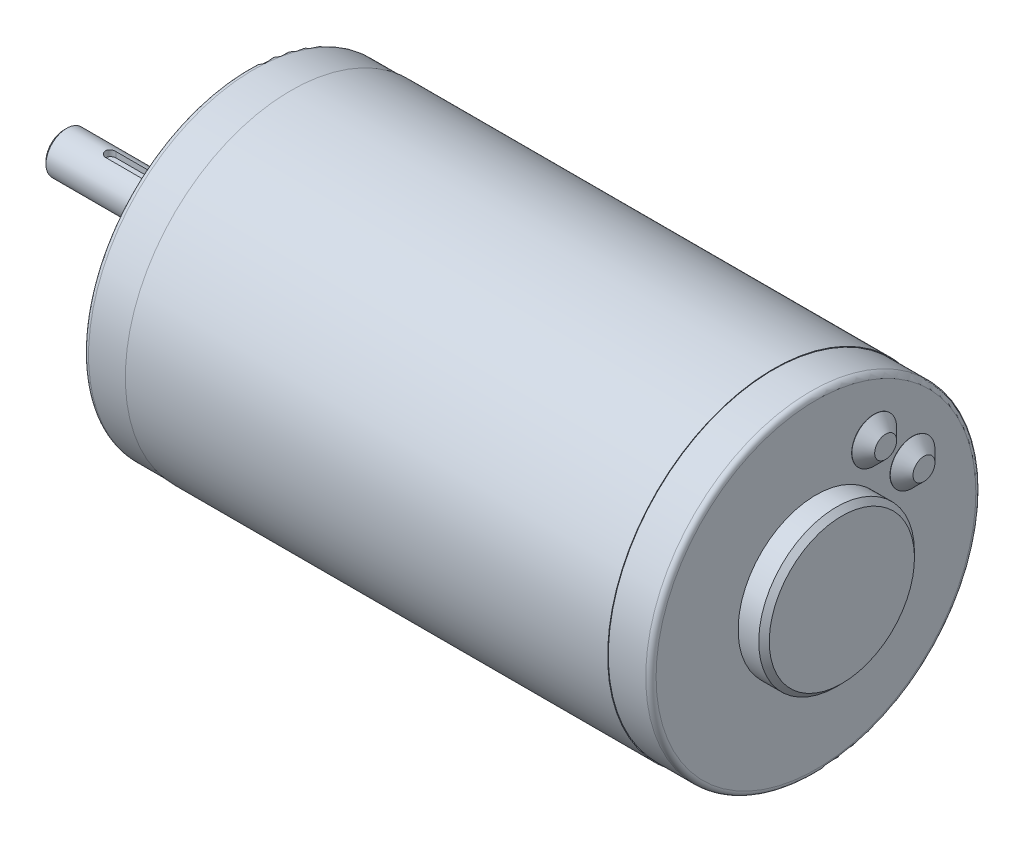
ISO-10303-21;
HEADER;
FILE_DESCRIPTION(('STEP AP214'),'2;1');
FILE_NAME('part.step','',(''),(''),'','','');
FILE_SCHEMA(('AUTOMOTIVE_DESIGN { 1 0 10303 214 1 1 1 1 }'));
ENDSEC;
DATA;
#1=APPLICATION_CONTEXT('core data for automotive mechanical design processes');
#2=APPLICATION_PROTOCOL_DEFINITION('international standard','automotive_design',2000,#1);
#3=PRODUCT_CONTEXT('',#1,'mechanical');
#4=PRODUCT('Part','Part','',(#3));
#5=PRODUCT_RELATED_PRODUCT_CATEGORY('part','',(#4));
#6=PRODUCT_DEFINITION_FORMATION('','',#4);
#7=PRODUCT_DEFINITION_CONTEXT('part definition',#1,'design');
#8=PRODUCT_DEFINITION('design','',#6,#7);
#9=PRODUCT_DEFINITION_SHAPE('','',#8);
#10=(LENGTH_UNIT() NAMED_UNIT(*) SI_UNIT(.MILLI.,.METRE.));
#11=(NAMED_UNIT(*) PLANE_ANGLE_UNIT() SI_UNIT($,.RADIAN.));
#12=(NAMED_UNIT(*) SI_UNIT($,.STERADIAN.) SOLID_ANGLE_UNIT());
#13=UNCERTAINTY_MEASURE_WITH_UNIT(LENGTH_MEASURE(1.E-05),#10,'distance_accuracy_value','');
#14=(GEOMETRIC_REPRESENTATION_CONTEXT(3) GLOBAL_UNCERTAINTY_ASSIGNED_CONTEXT((#13)) GLOBAL_UNIT_ASSIGNED_CONTEXT((#10,
#11,#12)) REPRESENTATION_CONTEXT('',''));
#15=CARTESIAN_POINT('',(0.,0.,0.));
#16=DIRECTION('',(0.,0.,1.));
#17=DIRECTION('',(1.,0.,0.));
#18=AXIS2_PLACEMENT_3D('',#15,#16,#17);
#19=CARTESIAN_POINT('',(-27.6,2.79999999999999,-1.));
#20=DIRECTION('',(0.,-1.,0.));
#21=DIRECTION('',(0.,0.,-1.));
#22=AXIS2_PLACEMENT_3D('',#19,#20,#21);
#23=PLANE('',#22);
#24=CARTESIAN_POINT('',(-7.1,2.79999999999999,0.));
#25=DIRECTION('',(0.,1.,0.));
#26=DIRECTION('',(0.,0.,1.));
#27=AXIS2_PLACEMENT_3D('',#24,#25,#26);
#28=CIRCLE('',#27,1.);
#29=CARTESIAN_POINT('',(-7.1,2.79999999999999,1.));
#30=VERTEX_POINT('',#29);
#31=CARTESIAN_POINT('',(-7.1,2.79999999999999,-1.));
#32=VERTEX_POINT('',#31);
#33=EDGE_CURVE('E79',#30,#32,#28,.T.);
#34=ORIENTED_EDGE('',*,*,#33,.T.);
#35=DIRECTION('',(1.,0.,0.));
#36=VECTOR('',#35,1.);
#37=CARTESIAN_POINT('',(-27.6,2.79999999999999,-1.));
#38=LINE('',#37,#36);
#39=CARTESIAN_POINT('',(-26.6,2.79999999999999,-1.));
#40=VERTEX_POINT('',#39);
#41=EDGE_CURVE('E74',#40,#32,#38,.T.);
#42=ORIENTED_EDGE('',*,*,#41,.F.);
#43=CARTESIAN_POINT('',(-26.6,2.79999999999999,0.));
#44=DIRECTION('',(0.,-1.,0.));
#45=DIRECTION('',(0.,0.,-1.));
#46=AXIS2_PLACEMENT_3D('',#43,#44,#45);
#47=CIRCLE('',#46,1.);
#48=CARTESIAN_POINT('',(-26.6,2.79999999999999,1.));
#49=VERTEX_POINT('',#48);
#50=EDGE_CURVE('E76',#40,#49,#47,.F.);
#51=ORIENTED_EDGE('',*,*,#50,.T.);
#52=DIRECTION('',(1.,0.,0.));
#53=VECTOR('',#52,1.);
#54=CARTESIAN_POINT('',(-27.6,2.79999999999999,1.));
#55=LINE('',#54,#53);
#56=EDGE_CURVE('E102',#49,#30,#55,.T.);
#57=ORIENTED_EDGE('',*,*,#56,.T.);
#58=EDGE_LOOP('',(#34,#42,#51,#57));
#59=FACE_BOUND('',#58,.T.);
#60=ADVANCED_FACE('F16',(#59),#23,.F.);
#61=CARTESIAN_POINT('',(-35.6,0.,0.));
#62=DIRECTION('',(-1.,0.,0.));
#63=DIRECTION('',(0.,0.,1.));
#64=AXIS2_PLACEMENT_3D('',#61,#62,#63);
#65=PLANE('',#64);
#66=CARTESIAN_POINT('',(-35.6000000000449,0.,0.));
#67=DIRECTION('',(1.,0.,0.));
#68=DIRECTION('',(0.,0.,-1.));
#69=AXIS2_PLACEMENT_3D('',#66,#67,#68);
#70=CIRCLE('',#69,3.49999999997408);
#71=CARTESIAN_POINT('',(-35.6000000000449,0.,-3.49999999997408));
#72=VERTEX_POINT('',#71);
#73=EDGE_CURVE('E327',#72,#72,#70,.T.);
#74=ORIENTED_EDGE('',*,*,#73,.F.);
#75=EDGE_LOOP('',(#74));
#76=FACE_BOUND('',#75,.T.);
#77=ADVANCED_FACE('F635',(#76),#65,.T.);
#78=CARTESIAN_POINT('',(-26.6,3.87298334620741,0.));
#79=DIRECTION('',(0.,-1.,0.));
#80=DIRECTION('',(0.,0.,-1.));
#81=AXIS2_PLACEMENT_3D('',#78,#79,#80);
#82=CYLINDRICAL_SURFACE('',#81,1.);
#83=CARTESIAN_POINT('',(-26.6,3.87298334620741,1.));
#84=CARTESIAN_POINT('',(-26.6276629851065,3.87298148580177,1.00000033749611));
#85=CARTESIAN_POINT('',(-26.6553122630182,3.8732800994947,0.998851407375366));
#86=CARTESIAN_POINT('',(-26.7104040353036,3.87445904774558,0.994271295395754));
#87=CARTESIAN_POINT('',(-26.7378465636871,3.87533928441687,0.990840497572679));
#88=CARTESIAN_POINT('',(-26.8194531732088,3.87881710972053,0.977175239382526));
#89=CARTESIAN_POINT('',(-26.8730564684822,3.88225203148808,0.963567695172493));
#90=CARTESIAN_POINT('',(-26.977124673782,3.89095422588002,0.927798076247996));
#91=CARTESIAN_POINT('',(-27.0275898782129,3.89622132630929,0.905636805423835));
#92=CARTESIAN_POINT('',(-27.1241114486473,3.90799134471939,0.853415378025864));
#93=CARTESIAN_POINT('',(-27.170166627891,3.91449459395647,0.823353103356932));
#94=CARTESIAN_POINT('',(-27.2575438819061,3.92816262398025,0.755484471828069));
#95=CARTESIAN_POINT('',(-27.2987548862455,3.93533791028915,0.717537268783975));
#96=CARTESIAN_POINT('',(-27.3743020894827,3.94945104396193,0.635275780516229));
#97=CARTESIAN_POINT('',(-27.4086371894679,3.95638885322537,0.59096047947883));
#98=CARTESIAN_POINT('',(-27.4699110016186,3.96936182283248,0.496456899401689));
#99=CARTESIAN_POINT('',(-27.496739895984,3.9753830468173,0.446195340334472));
#100=CARTESIAN_POINT('',(-27.5415247341967,3.98572346250588,0.341702590842916));
#101=CARTESIAN_POINT('',(-27.5594824242998,3.990042989147,0.287472184083007));
#102=CARTESIAN_POINT('',(-27.5856589927774,3.99641900005128,0.177744108525158));
#103=CARTESIAN_POINT('',(-27.5940676724228,3.998519529013,0.122294322002856));
#104=CARTESIAN_POINT('',(-27.6015033715433,4.00037438150815,0.0107327756816781));
#105=CARTESIAN_POINT('',(-27.6005315701923,4.00012899993444,-0.0453789000287067));
#106=CARTESIAN_POINT('',(-27.5893700363146,3.99735237365735,-0.155352492972096));
#107=CARTESIAN_POINT('',(-27.5793853834005,3.9948719867736,-0.209236701739855));
#108=CARTESIAN_POINT('',(-27.5508113208173,3.98796330636495,-0.31453871108434));
#109=CARTESIAN_POINT('',(-27.5322215304314,3.98353492665556,-0.365956402423988));
#110=CARTESIAN_POINT('',(-27.4867987193294,3.97314997761798,-0.46540728602454));
#111=CARTESIAN_POINT('',(-27.4598926057672,3.96717993827555,-0.513405629602248));
#112=CARTESIAN_POINT('',(-27.3986568701665,3.95435945541919,-0.604276631230015));
#113=CARTESIAN_POINT('',(-27.3643261297468,3.94750887933198,-0.64714851556229));
#114=CARTESIAN_POINT('',(-27.2881210879187,3.93345566022865,-0.727769389708492));
#115=CARTESIAN_POINT('',(-27.2460683634602,3.92624850477685,-0.765349103054128));
#116=CARTESIAN_POINT('',(-27.1561701330723,3.91246168284006,-0.832969575186237));
#117=CARTESIAN_POINT('',(-27.1083230467164,3.90588218842993,-0.863008270245062));
#118=CARTESIAN_POINT('',(-27.0078544021762,3.89407813586325,-0.914804709285961));
#119=CARTESIAN_POINT('',(-26.9552085351039,3.88886106009136,-0.936517017887269));
#120=CARTESIAN_POINT('',(-26.8468830715817,3.88047058807054,-0.970702351849828));
#121=CARTESIAN_POINT('',(-26.7912081448502,3.87729413761435,-0.983189189212131));
#122=CARTESIAN_POINT('',(-26.7125426192411,3.87455290681524,-0.993904635150938));
#123=CARTESIAN_POINT('',(-26.6900802967868,3.87396523110859,-0.996190790966708));
#124=CARTESIAN_POINT('',(-26.6450822100907,3.87318062488974,-0.999236757697394));
#125=CARTESIAN_POINT('',(-26.6225466240447,3.87298306219461,-0.999999038096045));
#126=CARTESIAN_POINT('',(-26.6,3.87298334620741,-1.));
#127=B_SPLINE_CURVE_WITH_KNOTS('',3,(#83,#84,#85,#86,#87,#88,#89,#90,#91,#92,#93,#94,#95,#96,
#97,#98,#99,#100,#101,#102,#103,#104,#105,#106,#107,#108,#109,#110,#111,#112,#113,#114,#115,
#116,#117,#118,#119,#120,#121,#122,#123,#124,#125,#126),.UNSPECIFIED.,.F.,.F.,(4,2,2,2,2,2,2,2,
2,2,2,2,2,2,2,2,2,2,2,2,2,4),(0.,0.0829365303397727,0.165859106084653,0.331229963080318,
0.496585282091499,0.661984974726751,0.830641897427976,0.999325753539196,1.17036187098235,
1.34136430732425,1.50890481515325,1.67642426256639,1.84022545479276,2.00403389475838,
2.16932509450376,2.33464120964329,2.50441429534542,2.67423379180967,2.84496720161068,
3.01544447539986,3.08315848722649,3.15076267731671),.UNSPECIFIED.);
#128=CARTESIAN_POINT('',(-26.6,3.87298334620741,1.));
#129=VERTEX_POINT('',#128);
#130=CARTESIAN_POINT('',(-26.6,3.87298334620741,-1.));
#131=VERTEX_POINT('',#130);
#132=EDGE_CURVE('E161',#129,#131,#127,.T.);
#133=ORIENTED_EDGE('',*,*,#132,.F.);
#134=DIRECTION('',(0.,1.,0.));
#135=VECTOR('',#134,1.);
#136=CARTESIAN_POINT('',(-26.6,2.79999999999999,1.));
#137=LINE('',#136,#135);
#138=EDGE_CURVE('E89',#129,#49,#137,.F.);
#139=ORIENTED_EDGE('',*,*,#138,.T.);
#140=ORIENTED_EDGE('',*,*,#50,.F.);
#141=DIRECTION('',(0.,1.,0.));
#142=VECTOR('',#141,1.);
#143=CARTESIAN_POINT('',(-26.6,2.79999999999999,-1.));
#144=LINE('',#143,#142);
#145=EDGE_CURVE('E83',#131,#40,#144,.F.);
#146=ORIENTED_EDGE('',*,*,#145,.F.);
#147=EDGE_LOOP('',(#133,#139,#140,#146));
#148=FACE_BOUND('',#147,.T.);
#149=ADVANCED_FACE('F86',(#148),#82,.F.);
#150=CARTESIAN_POINT('',(-27.6,2.79999999999999,-1.));
#151=DIRECTION('',(0.,0.,1.));
#152=DIRECTION('',(1.,0.,0.));
#153=AXIS2_PLACEMENT_3D('',#150,#151,#152);
#154=PLANE('',#153);
#155=DIRECTION('',(1.,0.,0.));
#156=VECTOR('',#155,1.);
#157=CARTESIAN_POINT('',(0.,3.87298334620741,-1.));
#158=LINE('',#157,#156);
#159=CARTESIAN_POINT('',(-7.1,3.87298334620741,-1.));
#160=VERTEX_POINT('',#159);
#161=EDGE_CURVE('E94',#131,#160,#158,.T.);
#162=ORIENTED_EDGE('',*,*,#161,.F.);
#163=ORIENTED_EDGE('',*,*,#145,.T.);
#164=ORIENTED_EDGE('',*,*,#41,.T.);
#165=DIRECTION('',(0.,1.,0.));
#166=VECTOR('',#165,1.);
#167=CARTESIAN_POINT('',(-7.1,2.79999999999999,-1.));
#168=LINE('',#167,#166);
#169=EDGE_CURVE('E97',#32,#160,#168,.T.);
#170=ORIENTED_EDGE('',*,*,#169,.T.);
#171=EDGE_LOOP('',(#162,#163,#164,#170));
#172=FACE_BOUND('',#171,.T.);
#173=ADVANCED_FACE('F92',(#172),#154,.T.);
#174=CARTESIAN_POINT('',(-7.1,2.79999999999999,0.));
#175=DIRECTION('',(0.,1.,0.));
#176=DIRECTION('',(0.,0.,1.));
#177=AXIS2_PLACEMENT_3D('',#174,#175,#176);
#178=CYLINDRICAL_SURFACE('',#177,1.);
#179=ORIENTED_EDGE('',*,*,#33,.F.);
#180=DIRECTION('',(0.,1.,0.));
#181=VECTOR('',#180,1.);
#182=CARTESIAN_POINT('',(-7.1,2.79999999999999,1.));
#183=LINE('',#182,#181);
#184=CARTESIAN_POINT('',(-7.1,3.87298334620741,1.));
#185=VERTEX_POINT('',#184);
#186=EDGE_CURVE('E103',#30,#185,#183,.T.);
#187=ORIENTED_EDGE('',*,*,#186,.T.);
#188=CARTESIAN_POINT('',(-7.1,3.87298334620741,-1.));
#189=CARTESIAN_POINT('',(-7.07233701489346,3.87298148580177,-1.00000033749611));
#190=CARTESIAN_POINT('',(-7.04468773698177,3.8732800994947,-0.998851407375366));
#191=CARTESIAN_POINT('',(-6.98959596469644,3.87445904774558,-0.994271295395754));
#192=CARTESIAN_POINT('',(-6.96215343631291,3.87533928441687,-0.990840497572679));
#193=CARTESIAN_POINT('',(-6.88054682679116,3.87881710972053,-0.977175239382526));
#194=CARTESIAN_POINT('',(-6.82694353151779,3.88225203148808,-0.963567695172493));
#195=CARTESIAN_POINT('',(-6.72287532621804,3.89095422588002,-0.927798076247997));
#196=CARTESIAN_POINT('',(-6.67241012178714,3.89622132630929,-0.905636805423836));
#197=CARTESIAN_POINT('',(-6.57588855135267,3.90799134471939,-0.853415378025865));
#198=CARTESIAN_POINT('',(-6.52983337210904,3.91449459395647,-0.823353103356933));
#199=CARTESIAN_POINT('',(-6.4424561180939,3.92816262398025,-0.755484471828069));
#200=CARTESIAN_POINT('',(-6.40124511375448,3.93533791028915,-0.717537268783976));
#201=CARTESIAN_POINT('',(-6.32569791051729,3.94945104396193,-0.63527578051623));
#202=CARTESIAN_POINT('',(-6.29136281053206,3.95638885322537,-0.590960479478831));
#203=CARTESIAN_POINT('',(-6.23008899838136,3.96936182283248,-0.496456899401691));
#204=CARTESIAN_POINT('',(-6.20326010401603,3.9753830468173,-0.446195340334474));
#205=CARTESIAN_POINT('',(-6.1584752658033,3.98572346250588,-0.341702590842919));
#206=CARTESIAN_POINT('',(-6.14051757570017,3.990042989147,-0.28747218408301));
#207=CARTESIAN_POINT('',(-6.11434100722257,3.99641900005128,-0.17774410852516));
#208=CARTESIAN_POINT('',(-6.10593232757718,3.998519529013,-0.122294322002858));
#209=CARTESIAN_POINT('',(-6.09849662845671,4.00037438150815,-0.0107327756816796));
#210=CARTESIAN_POINT('',(-6.09946842980766,4.00012899993444,0.0453789000287057));
#211=CARTESIAN_POINT('',(-6.11062996368545,3.99735237365735,0.155352492972096));
#212=CARTESIAN_POINT('',(-6.12061461659948,3.9948719867736,0.209236701739855));
#213=CARTESIAN_POINT('',(-6.14918867918275,3.98796330636495,0.31453871108434));
#214=CARTESIAN_POINT('',(-6.16777846956858,3.98353492665556,0.365956402423988));
#215=CARTESIAN_POINT('',(-6.21320128067065,3.97314997761798,0.465407286024539));
#216=CARTESIAN_POINT('',(-6.24010739423284,3.96717993827555,0.513405629602248));
#217=CARTESIAN_POINT('',(-6.30134312983347,3.95435945541919,0.604276631230014));
#218=CARTESIAN_POINT('',(-6.33567387025322,3.94750887933198,0.647148515562289));
#219=CARTESIAN_POINT('',(-6.41187891208131,3.93345566022865,0.72776938970849));
#220=CARTESIAN_POINT('',(-6.45393163653981,3.92624850477685,0.765349103054127));
#221=CARTESIAN_POINT('',(-6.54382986692773,3.91246168284006,0.832969575186237));
#222=CARTESIAN_POINT('',(-6.59167695328356,3.90588218842993,0.863008270245062));
#223=CARTESIAN_POINT('',(-6.69214559782377,3.89407813586325,0.914804709285962));
#224=CARTESIAN_POINT('',(-6.74479146489609,3.88886106009136,0.936517017887269));
#225=CARTESIAN_POINT('',(-6.85311692841829,3.88047058807055,0.970702351849829));
#226=CARTESIAN_POINT('',(-6.90879185514984,3.87729413761435,0.983189189212132));
#227=CARTESIAN_POINT('',(-6.9874573807589,3.87455290681524,0.993904635150938));
#228=CARTESIAN_POINT('',(-7.00991970321318,3.87396523110859,0.996190790966708));
#229=CARTESIAN_POINT('',(-7.05491778990932,3.87318062488974,0.999236757697394));
#230=CARTESIAN_POINT('',(-7.07745337595529,3.87298306219461,0.999999038096045));
#231=CARTESIAN_POINT('',(-7.1,3.87298334620741,1.));
#232=B_SPLINE_CURVE_WITH_KNOTS('',3,(#188,#189,#190,#191,#192,#193,#194,#195,#196,#197,#198,
#199,#200,#201,#202,#203,#204,#205,#206,#207,#208,#209,#210,#211,#212,#213,#214,#215,#216,#217,
#218,#219,#220,#221,#222,#223,#224,#225,#226,#227,#228,#229,#230,#231),.UNSPECIFIED.,.F.,.F.,(4,
2,2,2,2,2,2,2,2,2,2,2,2,2,2,2,2,2,2,2,2,4),(0.,0.0829365303397693,0.165859106084651,
0.331229963080317,0.496585282091498,0.661984974726749,0.830641897427974,0.999325753539193,
1.17036187098235,1.34136430732424,1.50890481515325,1.67642426256639,1.84022545479276,
2.00403389475838,2.16932509450376,2.33464120964329,2.50441429534542,2.67423379180967,
2.84496720161068,3.01544447539986,3.08315848722648,3.15076267731671),.UNSPECIFIED.);
#233=EDGE_CURVE('E151',#160,#185,#232,.T.);
#234=ORIENTED_EDGE('',*,*,#233,.F.);
#235=ORIENTED_EDGE('',*,*,#169,.F.);
#236=EDGE_LOOP('',(#179,#187,#234,#235));
#237=FACE_BOUND('',#236,.T.);
#238=ADVANCED_FACE('F168',(#237),#178,.F.);
#239=CARTESIAN_POINT('',(-27.6,2.79999999999999,1.));
#240=DIRECTION('',(0.,0.,1.));
#241=DIRECTION('',(1.,0.,0.));
#242=AXIS2_PLACEMENT_3D('',#239,#240,#241);
#243=PLANE('',#242);
#244=ORIENTED_EDGE('',*,*,#186,.F.);
#245=ORIENTED_EDGE('',*,*,#56,.F.);
#246=ORIENTED_EDGE('',*,*,#138,.F.);
#247=DIRECTION('',(1.,0.,0.));
#248=VECTOR('',#247,1.);
#249=CARTESIAN_POINT('',(0.,3.87298334620741,1.));
#250=LINE('',#249,#248);
#251=EDGE_CURVE('E160',#185,#129,#250,.F.);
#252=ORIENTED_EDGE('',*,*,#251,.F.);
#253=EDGE_LOOP('',(#244,#245,#246,#252));
#254=FACE_BOUND('',#253,.T.);
#255=ADVANCED_FACE('F183',(#254),#243,.F.);
#256=CARTESIAN_POINT('',(-35.0999999999999,0.,0.));
#257=DIRECTION('',(1.,0.,0.));
#258=DIRECTION('',(0.,0.,-1.));
#259=AXIS2_PLACEMENT_3D('',#256,#257,#258);
#260=CONICAL_SURFACE('',#259,3.99999999996226,0.785398163340605);
#261=ORIENTED_EDGE('',*,*,#73,.T.);
#262=EDGE_LOOP('',(#261));
#263=FACE_BOUND('',#262,.T.);
#264=CARTESIAN_POINT('',(-35.1,0.,0.));
#265=DIRECTION('',(1.,0.,0.));
#266=DIRECTION('',(0.,0.,-1.));
#267=AXIS2_PLACEMENT_3D('',#264,#265,#266);
#268=CIRCLE('',#267,4.);
#269=CARTESIAN_POINT('',(-35.1,0.,-4.));
#270=VERTEX_POINT('',#269);
#271=EDGE_CURVE('E150',#270,#270,#268,.T.);
#272=ORIENTED_EDGE('',*,*,#271,.F.);
#273=EDGE_LOOP('',(#272));
#274=FACE_BOUND('',#273,.T.);
#275=ADVANCED_FACE('F178',(#263,#274),#260,.T.);
#276=CARTESIAN_POINT('',(0.,0.,0.));
#277=DIRECTION('',(1.,0.,0.));
#278=DIRECTION('',(0.,0.,-1.));
#279=AXIS2_PLACEMENT_3D('',#276,#277,#278);
#280=CYLINDRICAL_SURFACE('',#279,4.);
#281=ORIENTED_EDGE('',*,*,#271,.T.);
#282=EDGE_LOOP('',(#281));
#283=FACE_BOUND('',#282,.T.);
#284=CARTESIAN_POINT('',(-4.,0.,0.));
#285=DIRECTION('',(1.,0.,0.));
#286=DIRECTION('',(0.,0.,-1.));
#287=AXIS2_PLACEMENT_3D('',#284,#285,#286);
#288=CIRCLE('',#287,4.);
#289=CARTESIAN_POINT('',(-4.,0.,-4.));
#290=VERTEX_POINT('',#289);
#291=EDGE_CURVE('E147',#290,#290,#288,.T.);
#292=ORIENTED_EDGE('',*,*,#291,.F.);
#293=EDGE_LOOP('',(#292));
#294=FACE_BOUND('',#293,.T.);
#295=ORIENTED_EDGE('',*,*,#233,.T.);
#296=ORIENTED_EDGE('',*,*,#251,.T.);
#297=ORIENTED_EDGE('',*,*,#132,.T.);
#298=ORIENTED_EDGE('',*,*,#161,.T.);
#299=EDGE_LOOP('',(#295,#296,#297,#298));
#300=FACE_BOUND('',#299,.T.);
#301=ADVANCED_FACE('F172',(#283,#294,#300),#280,.T.);
#302=CARTESIAN_POINT('',(-4.,4.,0.));
#303=DIRECTION('',(-1.,0.,0.));
#304=DIRECTION('',(0.,0.,1.));
#305=AXIS2_PLACEMENT_3D('',#302,#303,#304);
#306=PLANE('',#305);
#307=ORIENTED_EDGE('',*,*,#291,.T.);
#308=EDGE_LOOP('',(#307));
#309=FACE_BOUND('',#308,.T.);
#310=CARTESIAN_POINT('',(-4.,0.,0.));
#311=DIRECTION('',(1.,0.,0.));
#312=DIRECTION('',(0.,1.,0.));
#313=AXIS2_PLACEMENT_3D('',#310,#311,#312);
#314=CIRCLE('',#313,8.509);
#315=CARTESIAN_POINT('',(-4.,8.509,0.));
#316=VERTEX_POINT('',#315);
#317=EDGE_CURVE('E144',#316,#316,#314,.T.);
#318=ORIENTED_EDGE('',*,*,#317,.F.);
#319=EDGE_LOOP('',(#318));
#320=FACE_BOUND('',#319,.T.);
#321=ADVANCED_FACE('F177',(#309,#320),#306,.T.);
#322=CARTESIAN_POINT('',(111.8479,18.6070906828553,-11.2073596390943));
#323=DIRECTION('',(1.,0.,0.));
#324=DIRECTION('',(0.,0.,-1.));
#325=AXIS2_PLACEMENT_3D('',#322,#323,#324);
#326=PLANE('',#325);
#327=CARTESIAN_POINT('',(111.84789999993,18.6070906828553,-11.2073596390943));
#328=DIRECTION('',(-1.,0.,0.));
#329=DIRECTION('',(0.,-1.,0.));
#330=AXIS2_PLACEMENT_3D('',#327,#328,#329);
#331=CIRCLE('',#330,2.11800000003146);
#332=CARTESIAN_POINT('',(111.84789999993,16.4890906828238,-11.2073596390943));
#333=VERTEX_POINT('',#332);
#334=EDGE_CURVE('E141',#333,#333,#331,.T.);
#335=ORIENTED_EDGE('',*,*,#334,.F.);
#336=EDGE_LOOP('',(#335));
#337=FACE_BOUND('',#336,.T.);
#338=ADVANCED_FACE('F583',(#337),#326,.T.);
#339=CARTESIAN_POINT('',(114.6,15.0368,0.));
#340=DIRECTION('',(1.,0.,0.));
#341=DIRECTION('',(0.,0.,-1.));
#342=AXIS2_PLACEMENT_3D('',#339,#340,#341);
#343=PLANE('',#342);
#344=CARTESIAN_POINT('',(114.6,0.,0.));
#345=DIRECTION('',(-1.,0.,0.));
#346=DIRECTION('',(0.,-1.,0.));
#347=AXIS2_PLACEMENT_3D('',#344,#345,#346);
#348=CIRCLE('',#347,14.0208);
#349=CARTESIAN_POINT('',(114.6,-14.0208,0.));
#350=VERTEX_POINT('',#349);
#351=EDGE_CURVE('E138',#350,#350,#348,.T.);
#352=ORIENTED_EDGE('',*,*,#351,.F.);
#353=EDGE_LOOP('',(#352));
#354=FACE_BOUND('',#353,.T.);
#355=ADVANCED_FACE('F575',(#354),#343,.T.);
#356=CARTESIAN_POINT('',(111.8479,11.2073596390943,-18.6070906828553));
#357=DIRECTION('',(1.,0.,0.));
#358=DIRECTION('',(0.,0.,-1.));
#359=AXIS2_PLACEMENT_3D('',#356,#357,#358);
#360=PLANE('',#359);
#361=CARTESIAN_POINT('',(111.84789999993,11.2073596390943,-18.6070906828553));
#362=DIRECTION('',(-1.,0.,0.));
#363=DIRECTION('',(0.,0.,1.));
#364=AXIS2_PLACEMENT_3D('',#361,#362,#363);
#365=CIRCLE('',#364,2.1180000000021);
#366=CARTESIAN_POINT('',(111.84789999993,11.2073596390943,-16.4890906828532));
#367=VERTEX_POINT('',#366);
#368=EDGE_CURVE('E134',#367,#367,#365,.T.);
#369=ORIENTED_EDGE('',*,*,#368,.F.);
#370=EDGE_LOOP('',(#369));
#371=FACE_BOUND('',#370,.T.);
#372=ADVANCED_FACE('F365',(#371),#360,.T.);
#373=CARTESIAN_POINT('',(13.6143999999945,25.4,0.));
#374=DIRECTION('',(-1.,0.,0.));
#375=DIRECTION('',(0.,0.,1.));
#376=AXIS2_PLACEMENT_3D('',#373,#374,#375);
#377=CONICAL_SURFACE('',#376,2.01929999997219,1.02974425867198);
#378=CARTESIAN_POINT('',(14.827717847993,25.4,0.));
#379=VERTEX_POINT('',#378);
#380=VERTEX_LOOP('',#379);
#381=FACE_BOUND('',#380,.T.);
#382=CARTESIAN_POINT('',(13.6144,25.4,0.));
#383=DIRECTION('',(-1.,0.,0.));
#384=DIRECTION('',(0.,0.,1.));
#385=AXIS2_PLACEMENT_3D('',#382,#383,#384);
#386=CIRCLE('',#385,2.0193);
#387=CARTESIAN_POINT('',(13.6144,25.4,2.0193));
#388=VERTEX_POINT('',#387);
#389=EDGE_CURVE('E137',#388,#388,#386,.T.);
#390=ORIENTED_EDGE('',*,*,#389,.T.);
#391=EDGE_LOOP('',(#390));
#392=FACE_BOUND('',#391,.T.);
#393=ADVANCED_FACE('F362',(#381,#392),#377,.F.);
#394=CARTESIAN_POINT('',(13.6143999999945,-25.4,0.));
#395=DIRECTION('',(-1.,0.,0.));
#396=DIRECTION('',(0.,0.,1.));
#397=AXIS2_PLACEMENT_3D('',#394,#395,#396);
#398=CONICAL_SURFACE('',#397,2.01929999997219,1.02974425867198);
#399=CARTESIAN_POINT('',(14.827717847993,-25.4,0.));
#400=VERTEX_POINT('',#399);
#401=VERTEX_LOOP('',#400);
#402=FACE_BOUND('',#401,.T.);
#403=CARTESIAN_POINT('',(13.6144,-25.4,0.));
#404=DIRECTION('',(-1.,0.,0.));
#405=DIRECTION('',(0.,0.,1.));
#406=AXIS2_PLACEMENT_3D('',#403,#404,#405);
#407=CIRCLE('',#406,2.0193);
#408=CARTESIAN_POINT('',(13.6144,-25.4,2.0193));
#409=VERTEX_POINT('',#408);
#410=EDGE_CURVE('E317',#409,#409,#407,.T.);
#411=ORIENTED_EDGE('',*,*,#410,.T.);
#412=EDGE_LOOP('',(#411));
#413=FACE_BOUND('',#412,.T.);
#414=ADVANCED_FACE('F358',(#402,#413),#398,.F.);
#415=CARTESIAN_POINT('',(-2.984,0.,0.));
#416=DIRECTION('',(1.,0.,0.));
#417=DIRECTION('',(0.,1.,0.));
#418=AXIS2_PLACEMENT_3D('',#415,#416,#417);
#419=CONICAL_SURFACE('',#418,9.525,0.78539816339745);
#420=ORIENTED_EDGE('',*,*,#317,.T.);
#421=EDGE_LOOP('',(#420));
#422=FACE_BOUND('',#421,.T.);
#423=CARTESIAN_POINT('',(-2.984,0.,0.));
#424=DIRECTION('',(1.,0.,0.));
#425=DIRECTION('',(0.,0.,-1.));
#426=AXIS2_PLACEMENT_3D('',#423,#424,#425);
#427=CIRCLE('',#426,9.525);
#428=CARTESIAN_POINT('',(-2.984,0.,-9.525));
#429=VERTEX_POINT('',#428);
#430=EDGE_CURVE('E314',#429,#429,#427,.T.);
#431=ORIENTED_EDGE('',*,*,#430,.F.);
#432=EDGE_LOOP('',(#431));
#433=FACE_BOUND('',#432,.T.);
#434=ADVANCED_FACE('F382',(#422,#433),#419,.T.);
#435=CARTESIAN_POINT('',(109.647900000027,18.6070906828553,-11.2073596390943));
#436=DIRECTION('',(-1.,0.,0.));
#437=DIRECTION('',(0.,-1.,0.));
#438=AXIS2_PLACEMENT_3D('',#435,#436,#437);
#439=CONICAL_SURFACE('',#438,4.31799999987712,0.785398163384529);
#440=CARTESIAN_POINT('',(109.6479,18.6070906828553,-11.2073596390943));
#441=DIRECTION('',(-1.,0.,0.));
#442=DIRECTION('',(0.,0.,1.));
#443=AXIS2_PLACEMENT_3D('',#440,#441,#442);
#444=CIRCLE('',#443,4.318);
#445=CARTESIAN_POINT('',(109.6479,18.6070906828553,-6.88935963909434));
#446=VERTEX_POINT('',#445);
#447=EDGE_CURVE('E311',#446,#446,#444,.T.);
#448=ORIENTED_EDGE('',*,*,#447,.F.);
#449=EDGE_LOOP('',(#448));
#450=FACE_BOUND('',#449,.T.);
#451=ORIENTED_EDGE('',*,*,#334,.T.);
#452=EDGE_LOOP('',(#451));
#453=FACE_BOUND('',#452,.T.);
#454=ADVANCED_FACE('F391',(#450,#453),#439,.T.);
#455=CARTESIAN_POINT('',(113.584,0.,0.));
#456=DIRECTION('',(-1.,0.,0.));
#457=DIRECTION('',(0.,-1.,0.));
#458=AXIS2_PLACEMENT_3D('',#455,#456,#457);
#459=CONICAL_SURFACE('',#458,15.0368,0.785398163397441);
#460=ORIENTED_EDGE('',*,*,#351,.T.);
#461=EDGE_LOOP('',(#460));
#462=FACE_BOUND('',#461,.T.);
#463=CARTESIAN_POINT('',(113.584,0.,0.));
#464=DIRECTION('',(1.,0.,0.));
#465=DIRECTION('',(0.,0.,-1.));
#466=AXIS2_PLACEMENT_3D('',#463,#464,#465);
#467=CIRCLE('',#466,15.0368);
#468=CARTESIAN_POINT('',(113.584,0.,-15.0368));
#469=VERTEX_POINT('',#468);
#470=EDGE_CURVE('E308',#469,#469,#467,.F.);
#471=ORIENTED_EDGE('',*,*,#470,.F.);
#472=EDGE_LOOP('',(#471));
#473=FACE_BOUND('',#472,.T.);
#474=ADVANCED_FACE('F403',(#462,#473),#459,.T.);
#475=CARTESIAN_POINT('',(109.647900000084,11.2073596390943,-18.6070906828553));
#476=DIRECTION('',(-1.,0.,0.));
#477=DIRECTION('',(0.,0.,1.));
#478=AXIS2_PLACEMENT_3D('',#475,#476,#477);
#479=CONICAL_SURFACE('',#478,4.31799999990461,0.785398163410367);
#480=CARTESIAN_POINT('',(109.6479,11.2073596390943,-18.6070906828553));
#481=DIRECTION('',(-1.,0.,0.));
#482=DIRECTION('',(0.,0.,1.));
#483=AXIS2_PLACEMENT_3D('',#480,#481,#482);
#484=CIRCLE('',#483,4.318);
#485=CARTESIAN_POINT('',(109.6479,11.2073596390943,-14.2890906828553));
#486=VERTEX_POINT('',#485);
#487=EDGE_CURVE('E133',#486,#486,#484,.T.);
#488=ORIENTED_EDGE('',*,*,#487,.F.);
#489=EDGE_LOOP('',(#488));
#490=FACE_BOUND('',#489,.T.);
#491=ORIENTED_EDGE('',*,*,#368,.T.);
#492=EDGE_LOOP('',(#491));
#493=FACE_BOUND('',#492,.T.);
#494=ADVANCED_FACE('F414',(#490,#493),#479,.T.);
#495=CARTESIAN_POINT('',(0.,25.4,0.));
#496=DIRECTION('',(-1.,0.,0.));
#497=DIRECTION('',(0.,0.,1.));
#498=AXIS2_PLACEMENT_3D('',#495,#496,#497);
#499=CYLINDRICAL_SURFACE('',#498,2.0193);
#500=CARTESIAN_POINT('',(0.,25.4,0.));
#501=DIRECTION('',(-1.,0.,0.));
#502=DIRECTION('',(0.,0.,1.));
#503=AXIS2_PLACEMENT_3D('',#500,#501,#502);
#504=CIRCLE('',#503,2.0193);
#505=CARTESIAN_POINT('',(0.,25.4,2.0193));
#506=VERTEX_POINT('',#505);
#507=EDGE_CURVE('E130',#506,#506,#504,.F.);
#508=ORIENTED_EDGE('',*,*,#507,.F.);
#509=EDGE_LOOP('',(#508));
#510=FACE_BOUND('',#509,.T.);
#511=ORIENTED_EDGE('',*,*,#389,.F.);
#512=EDGE_LOOP('',(#511));
#513=FACE_BOUND('',#512,.T.);
#514=ADVANCED_FACE('F426',(#510,#513),#499,.F.);
#515=CARTESIAN_POINT('',(0.,-25.4,0.));
#516=DIRECTION('',(-1.,0.,0.));
#517=DIRECTION('',(0.,0.,1.));
#518=AXIS2_PLACEMENT_3D('',#515,#516,#517);
#519=CYLINDRICAL_SURFACE('',#518,2.0193);
#520=CARTESIAN_POINT('',(0.,-25.4,0.));
#521=DIRECTION('',(-1.,0.,0.));
#522=DIRECTION('',(0.,0.,1.));
#523=AXIS2_PLACEMENT_3D('',#520,#521,#522);
#524=CIRCLE('',#523,2.0193);
#525=CARTESIAN_POINT('',(0.,-25.4,2.0193));
#526=VERTEX_POINT('',#525);
#527=EDGE_CURVE('E127',#526,#526,#524,.F.);
#528=ORIENTED_EDGE('',*,*,#527,.F.);
#529=EDGE_LOOP('',(#528));
#530=FACE_BOUND('',#529,.T.);
#531=ORIENTED_EDGE('',*,*,#410,.F.);
#532=EDGE_LOOP('',(#531));
#533=FACE_BOUND('',#532,.T.);
#534=ADVANCED_FACE('F436',(#530,#533),#519,.F.);
#535=CARTESIAN_POINT('',(0.,0.,0.));
#536=DIRECTION('',(1.,0.,0.));
#537=DIRECTION('',(0.,0.,-1.));
#538=AXIS2_PLACEMENT_3D('',#535,#536,#537);
#539=CYLINDRICAL_SURFACE('',#538,9.525);
#540=ORIENTED_EDGE('',*,*,#430,.T.);
#541=EDGE_LOOP('',(#540));
#542=FACE_BOUND('',#541,.T.);
#543=CARTESIAN_POINT('',(0.,0.,0.));
#544=DIRECTION('',(1.,0.,0.));
#545=DIRECTION('',(0.,0.,-1.));
#546=AXIS2_PLACEMENT_3D('',#543,#544,#545);
#547=CIRCLE('',#546,9.525);
#548=CARTESIAN_POINT('',(0.,0.,-9.525));
#549=VERTEX_POINT('',#548);
#550=EDGE_CURVE('E124',#549,#549,#547,.T.);
#551=ORIENTED_EDGE('',*,*,#550,.F.);
#552=EDGE_LOOP('',(#551));
#553=FACE_BOUND('',#552,.T.);
#554=ADVANCED_FACE('F446',(#542,#553),#539,.T.);
#555=CARTESIAN_POINT('',(111.8479,18.6070906828553,-11.2073596390943));
#556=DIRECTION('',(-1.,0.,0.));
#557=DIRECTION('',(0.,0.,1.));
#558=AXIS2_PLACEMENT_3D('',#555,#556,#557);
#559=CYLINDRICAL_SURFACE('',#558,4.318);
#560=CARTESIAN_POINT('',(109.6,18.6070906828553,-11.2073596390943));
#561=DIRECTION('',(-1.,0.,0.));
#562=DIRECTION('',(0.,0.,1.));
#563=AXIS2_PLACEMENT_3D('',#560,#561,#562);
#564=CIRCLE('',#563,4.318);
#565=CARTESIAN_POINT('',(109.6,18.6070906828553,-6.88935963909434));
#566=VERTEX_POINT('',#565);
#567=EDGE_CURVE('E121',#566,#566,#564,.T.);
#568=ORIENTED_EDGE('',*,*,#567,.F.);
#569=EDGE_LOOP('',(#568));
#570=FACE_BOUND('',#569,.T.);
#571=ORIENTED_EDGE('',*,*,#447,.T.);
#572=EDGE_LOOP('',(#571));
#573=FACE_BOUND('',#572,.T.);
#574=ADVANCED_FACE('F455',(#570,#573),#559,.T.);
#575=CARTESIAN_POINT('',(0.,0.,0.));
#576=DIRECTION('',(1.,0.,0.));
#577=DIRECTION('',(0.,0.,-1.));
#578=AXIS2_PLACEMENT_3D('',#575,#576,#577);
#579=CYLINDRICAL_SURFACE('',#578,15.0368);
#580=CARTESIAN_POINT('',(109.6,0.,0.));
#581=DIRECTION('',(1.,0.,0.));
#582=DIRECTION('',(0.,0.,-1.));
#583=AXIS2_PLACEMENT_3D('',#580,#581,#582);
#584=CIRCLE('',#583,15.0368);
#585=CARTESIAN_POINT('',(109.6,0.,-15.0368));
#586=VERTEX_POINT('',#585);
#587=EDGE_CURVE('E118',#586,#586,#584,.F.);
#588=ORIENTED_EDGE('',*,*,#587,.F.);
#589=EDGE_LOOP('',(#588));
#590=FACE_BOUND('',#589,.T.);
#591=ORIENTED_EDGE('',*,*,#470,.T.);
#592=EDGE_LOOP('',(#591));
#593=FACE_BOUND('',#592,.T.);
#594=ADVANCED_FACE('F465',(#590,#593),#579,.T.);
#595=CARTESIAN_POINT('',(111.8479,11.2073596390943,-18.6070906828553));
#596=DIRECTION('',(-1.,0.,0.));
#597=DIRECTION('',(0.,0.,1.));
#598=AXIS2_PLACEMENT_3D('',#595,#596,#597);
#599=CYLINDRICAL_SURFACE('',#598,4.318);
#600=CARTESIAN_POINT('',(109.6,11.2073596390943,-18.6070906828553));
#601=DIRECTION('',(-1.,0.,0.));
#602=DIRECTION('',(0.,0.,1.));
#603=AXIS2_PLACEMENT_3D('',#600,#601,#602);
#604=CIRCLE('',#603,4.318);
#605=CARTESIAN_POINT('',(109.6,11.2073596390943,-14.2890906828553));
#606=VERTEX_POINT('',#605);
#607=EDGE_CURVE('E114',#606,#606,#604,.T.);
#608=ORIENTED_EDGE('',*,*,#607,.F.);
#609=EDGE_LOOP('',(#608));
#610=FACE_BOUND('',#609,.T.);
#611=ORIENTED_EDGE('',*,*,#487,.T.);
#612=EDGE_LOOP('',(#611));
#613=FACE_BOUND('',#612,.T.);
#614=ADVANCED_FACE('F473',(#610,#613),#599,.T.);
#615=CARTESIAN_POINT('',(0.,9.525,0.));
#616=DIRECTION('',(-1.,0.,0.));
#617=DIRECTION('',(0.,0.,1.));
#618=AXIS2_PLACEMENT_3D('',#615,#616,#617);
#619=PLANE('',#618);
#620=ORIENTED_EDGE('',*,*,#550,.T.);
#621=EDGE_LOOP('',(#620));
#622=FACE_BOUND('',#621,.T.);
#623=CARTESIAN_POINT('',(0.,0.,0.));
#624=DIRECTION('',(1.,0.,0.));
#625=DIRECTION('',(0.,0.,-1.));
#626=AXIS2_PLACEMENT_3D('',#623,#624,#625);
#627=CIRCLE('',#626,30.877);
#628=CARTESIAN_POINT('',(0.,0.,-30.877));
#629=VERTEX_POINT('',#628);
#630=CARTESIAN_POINT('',(0.,0.,30.877));
#631=VERTEX_POINT('',#630);
#632=EDGE_CURVE('E117',#629,#631,#627,.T.);
#633=ORIENTED_EDGE('',*,*,#632,.F.);
#634=CARTESIAN_POINT('',(0.,0.,0.));
#635=DIRECTION('',(1.,0.,0.));
#636=DIRECTION('',(0.,0.,1.));
#637=AXIS2_PLACEMENT_3D('',#634,#635,#636);
#638=CIRCLE('',#637,30.877);
#639=EDGE_CURVE('E287',#631,#629,#638,.T.);
#640=ORIENTED_EDGE('',*,*,#639,.F.);
#641=EDGE_LOOP('',(#633,#640));
#642=FACE_BOUND('',#641,.T.);
#643=ORIENTED_EDGE('',*,*,#527,.T.);
#644=EDGE_LOOP('',(#643));
#645=FACE_BOUND('',#644,.T.);
#646=ORIENTED_EDGE('',*,*,#507,.T.);
#647=EDGE_LOOP('',(#646));
#648=FACE_BOUND('',#647,.T.);
#649=ADVANCED_FACE('F253',(#622,#642,#645,#648),#619,.T.);
#650=CARTESIAN_POINT('',(109.6,31.877,0.));
#651=DIRECTION('',(1.,0.,0.));
#652=DIRECTION('',(0.,0.,-1.));
#653=AXIS2_PLACEMENT_3D('',#650,#651,#652);
#654=PLANE('',#653);
#655=ORIENTED_EDGE('',*,*,#607,.T.);
#656=EDGE_LOOP('',(#655));
#657=FACE_BOUND('',#656,.T.);
#658=ORIENTED_EDGE('',*,*,#587,.T.);
#659=EDGE_LOOP('',(#658));
#660=FACE_BOUND('',#659,.T.);
#661=CARTESIAN_POINT('',(109.6,0.,0.));
#662=DIRECTION('',(-1.,0.,0.));
#663=DIRECTION('',(0.,0.,1.));
#664=AXIS2_PLACEMENT_3D('',#661,#662,#663);
#665=CIRCLE('',#664,30.877);
#666=CARTESIAN_POINT('',(109.6,0.,30.877));
#667=VERTEX_POINT('',#666);
#668=CARTESIAN_POINT('',(109.6,0.,-30.877));
#669=VERTEX_POINT('',#668);
#670=EDGE_CURVE('E35',#667,#669,#665,.T.);
#671=ORIENTED_EDGE('',*,*,#670,.F.);
#672=CARTESIAN_POINT('',(109.6,0.,0.));
#673=DIRECTION('',(-1.,0.,0.));
#674=DIRECTION('',(0.,0.,-1.));
#675=AXIS2_PLACEMENT_3D('',#672,#673,#674);
#676=CIRCLE('',#675,30.877);
#677=EDGE_CURVE('E235',#669,#667,#676,.T.);
#678=ORIENTED_EDGE('',*,*,#677,.F.);
#679=EDGE_LOOP('',(#671,#678));
#680=FACE_BOUND('',#679,.T.);
#681=ORIENTED_EDGE('',*,*,#567,.T.);
#682=EDGE_LOOP('',(#681));
#683=FACE_BOUND('',#682,.T.);
#684=ADVANCED_FACE('F244',(#657,#660,#680,#683),#654,.T.);
#685=CARTESIAN_POINT('',(0.999999999999999,0.,0.));
#686=DIRECTION('',(-1.,0.,0.));
#687=DIRECTION('',(0.,0.,1.));
#688=AXIS2_PLACEMENT_3D('',#685,#686,#687);
#689=TOROIDAL_SURFACE('',#688,30.877,1.);
#690=CARTESIAN_POINT('',(0.999999999999999,0.,0.));
#691=DIRECTION('',(1.,0.,0.));
#692=DIRECTION('',(0.,0.,-1.));
#693=AXIS2_PLACEMENT_3D('',#690,#691,#692);
#694=CIRCLE('',#693,31.877);
#695=CARTESIAN_POINT('',(0.999999999999999,0.,-31.877));
#696=VERTEX_POINT('',#695);
#697=EDGE_CURVE('E233',#696,#696,#694,.T.);
#698=ORIENTED_EDGE('',*,*,#697,.F.);
#699=EDGE_LOOP('',(#698));
#700=FACE_BOUND('',#699,.T.);
#701=ORIENTED_EDGE('',*,*,#639,.T.);
#702=ORIENTED_EDGE('',*,*,#632,.T.);
#703=EDGE_LOOP('',(#701,#702));
#704=FACE_BOUND('',#703,.T.);
#705=ADVANCED_FACE('F222',(#700,#704),#689,.T.);
#706=CARTESIAN_POINT('',(108.6,0.,0.));
#707=DIRECTION('',(1.,0.,0.));
#708=DIRECTION('',(0.,0.,-1.));
#709=AXIS2_PLACEMENT_3D('',#706,#707,#708);
#710=TOROIDAL_SURFACE('',#709,30.877,1.);
#711=CARTESIAN_POINT('',(108.6,0.,0.));
#712=DIRECTION('',(1.,0.,0.));
#713=DIRECTION('',(0.,0.,-1.));
#714=AXIS2_PLACEMENT_3D('',#711,#712,#713);
#715=CIRCLE('',#714,31.877);
#716=CARTESIAN_POINT('',(108.6,0.,-31.877));
#717=VERTEX_POINT('',#716);
#718=EDGE_CURVE('E113',#717,#717,#715,.F.);
#719=ORIENTED_EDGE('',*,*,#718,.F.);
#720=EDGE_LOOP('',(#719));
#721=FACE_BOUND('',#720,.T.);
#722=ORIENTED_EDGE('',*,*,#677,.T.);
#723=ORIENTED_EDGE('',*,*,#670,.T.);
#724=EDGE_LOOP('',(#722,#723));
#725=FACE_BOUND('',#724,.T.);
#726=ADVANCED_FACE('F217',(#721,#725),#710,.T.);
#727=CARTESIAN_POINT('',(0.,0.,0.));
#728=DIRECTION('',(1.,0.,0.));
#729=DIRECTION('',(0.,0.,-1.));
#730=AXIS2_PLACEMENT_3D('',#727,#728,#729);
#731=CYLINDRICAL_SURFACE('',#730,31.877);
#732=ORIENTED_EDGE('',*,*,#697,.T.);
#733=EDGE_LOOP('',(#732));
#734=FACE_BOUND('',#733,.T.);
#735=CARTESIAN_POINT('',(8.2296,0.,0.));
#736=DIRECTION('',(1.,0.,0.));
#737=DIRECTION('',(0.,0.,-1.));
#738=AXIS2_PLACEMENT_3D('',#735,#736,#737);
#739=CIRCLE('',#738,31.877);
#740=CARTESIAN_POINT('',(8.2296,0.,-31.877));
#741=VERTEX_POINT('',#740);
#742=EDGE_CURVE('E110',#741,#741,#739,.T.);
#743=ORIENTED_EDGE('',*,*,#742,.F.);
#744=EDGE_LOOP('',(#743));
#745=FACE_BOUND('',#744,.T.);
#746=ADVANCED_FACE('F213',(#734,#745),#731,.T.);
#747=CARTESIAN_POINT('',(0.,0.,0.));
#748=DIRECTION('',(1.,0.,0.));
#749=DIRECTION('',(0.,0.,-1.));
#750=AXIS2_PLACEMENT_3D('',#747,#748,#749);
#751=CYLINDRICAL_SURFACE('',#750,31.877);
#752=CARTESIAN_POINT('',(101.3704,0.,0.));
#753=DIRECTION('',(1.,0.,0.));
#754=DIRECTION('',(0.,0.,-1.));
#755=AXIS2_PLACEMENT_3D('',#752,#753,#754);
#756=CIRCLE('',#755,31.877);
#757=CARTESIAN_POINT('',(101.3704,0.,-31.877));
#758=VERTEX_POINT('',#757);
#759=EDGE_CURVE('E107',#758,#758,#756,.F.);
#760=ORIENTED_EDGE('',*,*,#759,.F.);
#761=EDGE_LOOP('',(#760));
#762=FACE_BOUND('',#761,.T.);
#763=ORIENTED_EDGE('',*,*,#718,.T.);
#764=EDGE_LOOP('',(#763));
#765=FACE_BOUND('',#764,.T.);
#766=ADVANCED_FACE('F210',(#762,#765),#751,.T.);
#767=CARTESIAN_POINT('',(8.2296,31.877,0.));
#768=DIRECTION('',(-1.,0.,0.));
#769=DIRECTION('',(0.,0.,1.));
#770=AXIS2_PLACEMENT_3D('',#767,#768,#769);
#771=PLANE('',#770);
#772=CARTESIAN_POINT('',(8.2296,0.,0.));
#773=DIRECTION('',(1.,0.,0.));
#774=DIRECTION('',(0.,0.,-1.));
#775=AXIS2_PLACEMENT_3D('',#772,#773,#774);
#776=CIRCLE('',#775,32.004);
#777=CARTESIAN_POINT('',(8.2296,0.,-32.004));
#778=VERTEX_POINT('',#777);
#779=EDGE_CURVE('E27',#778,#778,#776,.T.);
#780=ORIENTED_EDGE('',*,*,#779,.F.);
#781=EDGE_LOOP('',(#780));
#782=FACE_BOUND('',#781,.T.);
#783=ORIENTED_EDGE('',*,*,#742,.T.);
#784=EDGE_LOOP('',(#783));
#785=FACE_BOUND('',#784,.T.);
#786=ADVANCED_FACE('F203',(#782,#785),#771,.T.);
#787=CARTESIAN_POINT('',(101.3704,32.004,0.));
#788=DIRECTION('',(1.,0.,0.));
#789=DIRECTION('',(0.,0.,-1.));
#790=AXIS2_PLACEMENT_3D('',#787,#788,#789);
#791=PLANE('',#790);
#792=ORIENTED_EDGE('',*,*,#759,.T.);
#793=EDGE_LOOP('',(#792));
#794=FACE_BOUND('',#793,.T.);
#795=CARTESIAN_POINT('',(101.3704,0.,0.));
#796=DIRECTION('',(1.,0.,0.));
#797=DIRECTION('',(0.,0.,-1.));
#798=AXIS2_PLACEMENT_3D('',#795,#796,#797);
#799=CIRCLE('',#798,32.004);
#800=CARTESIAN_POINT('',(101.3704,0.,-32.004));
#801=VERTEX_POINT('',#800);
#802=EDGE_CURVE('E11',#801,#801,#799,.F.);
#803=ORIENTED_EDGE('',*,*,#802,.F.);
#804=EDGE_LOOP('',(#803));
#805=FACE_BOUND('',#804,.T.);
#806=ADVANCED_FACE('F196',(#794,#805),#791,.T.);
#807=CARTESIAN_POINT('',(0.,0.,0.));
#808=DIRECTION('',(1.,0.,0.));
#809=DIRECTION('',(0.,0.,-1.));
#810=AXIS2_PLACEMENT_3D('',#807,#808,#809);
#811=CYLINDRICAL_SURFACE('',#810,32.004);
#812=ORIENTED_EDGE('',*,*,#802,.T.);
#813=EDGE_LOOP('',(#812));
#814=FACE_BOUND('',#813,.T.);
#815=ORIENTED_EDGE('',*,*,#779,.T.);
#816=EDGE_LOOP('',(#815));
#817=FACE_BOUND('',#816,.T.);
#818=ADVANCED_FACE('F194',(#814,#817),#811,.T.);
#819=CLOSED_SHELL('',(#60,#77,#149,#173,#238,#255,#275,#301,#321,#338,#355,#372,#393,#414,#434,
#454,#474,#494,#514,#534,#554,#574,#594,#614,#649,#684,#705,#726,#746,#766,#786,#806,#818));
#820=MANIFOLD_SOLID_BREP('B1',#819);
#821=ADVANCED_BREP_SHAPE_REPRESENTATION('',(#18,#820),#14);
#822=SHAPE_DEFINITION_REPRESENTATION(#9,#821);
ENDSEC;
END-ISO-10303-21;
